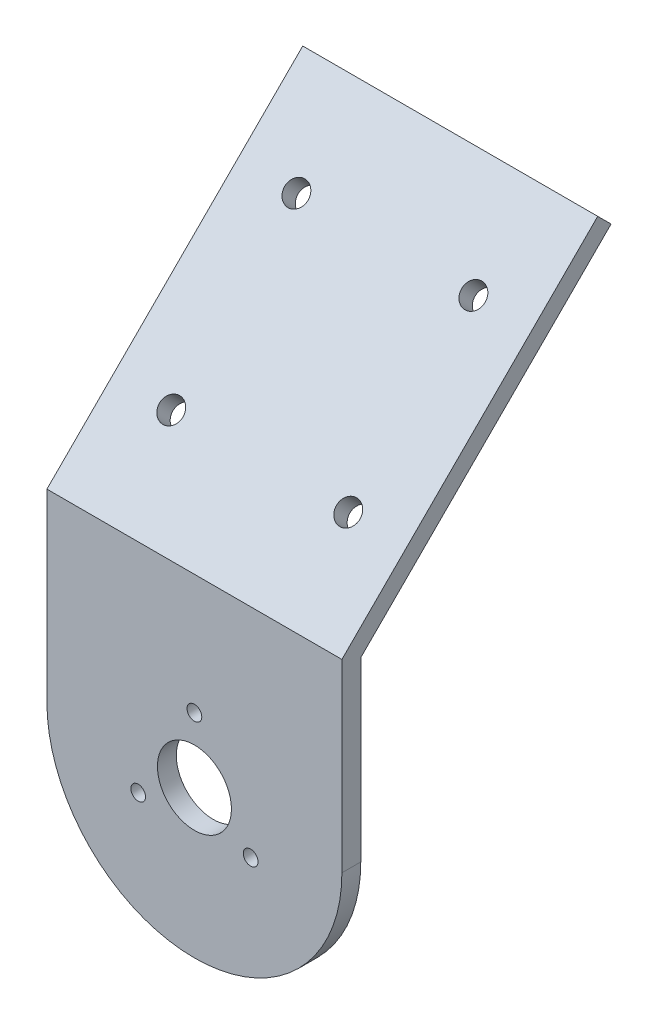
ISO-10303-21;
HEADER;
FILE_DESCRIPTION(('STEP AP214'),'2;1');
FILE_NAME('part.step','',(''),(''),'','','');
FILE_SCHEMA(('AUTOMOTIVE_DESIGN { 1 0 10303 214 1 1 1 1 }'));
ENDSEC;
DATA;
#1=APPLICATION_CONTEXT('core data for automotive mechanical design processes');
#2=APPLICATION_PROTOCOL_DEFINITION('international standard','automotive_design',2000,#1);
#3=PRODUCT_CONTEXT('',#1,'mechanical');
#4=PRODUCT('Part','Part','',(#3));
#5=PRODUCT_RELATED_PRODUCT_CATEGORY('part','',(#4));
#6=PRODUCT_DEFINITION_FORMATION('','',#4);
#7=PRODUCT_DEFINITION_CONTEXT('part definition',#1,'design');
#8=PRODUCT_DEFINITION('design','',#6,#7);
#9=PRODUCT_DEFINITION_SHAPE('','',#8);
#10=(LENGTH_UNIT() NAMED_UNIT(*) SI_UNIT(.MILLI.,.METRE.));
#11=(NAMED_UNIT(*) PLANE_ANGLE_UNIT() SI_UNIT($,.RADIAN.));
#12=(NAMED_UNIT(*) SI_UNIT($,.STERADIAN.) SOLID_ANGLE_UNIT());
#13=UNCERTAINTY_MEASURE_WITH_UNIT(LENGTH_MEASURE(1.E-05),#10,'distance_accuracy_value','');
#14=(GEOMETRIC_REPRESENTATION_CONTEXT(3) GLOBAL_UNCERTAINTY_ASSIGNED_CONTEXT((#13)) GLOBAL_UNIT_ASSIGNED_CONTEXT((#10,
#11,#12)) REPRESENTATION_CONTEXT('',''));
#15=CARTESIAN_POINT('',(0.,0.,0.));
#16=DIRECTION('',(0.,0.,1.));
#17=DIRECTION('',(1.,0.,0.));
#18=AXIS2_PLACEMENT_3D('',#15,#16,#17);
#19=CARTESIAN_POINT('',(9.526279441629,-5.5,77.5303437365925));
#20=DIRECTION('',(0.,0.,-1.));
#21=DIRECTION('',(-1.,0.,0.));
#22=AXIS2_PLACEMENT_3D('',#19,#20,#21);
#23=CYLINDRICAL_SURFACE('',#22,1.24999999999999);
#24=CARTESIAN_POINT('',(9.526279441629,-5.5,0.));
#25=DIRECTION('',(0.,0.,1.));
#26=DIRECTION('',(1.,0.,0.));
#27=AXIS2_PLACEMENT_3D('',#24,#25,#26);
#28=CIRCLE('',#27,1.24999999999999);
#29=CARTESIAN_POINT('',(10.776279441629,-5.5,0.));
#30=VERTEX_POINT('',#29);
#31=EDGE_CURVE('E120',#30,#30,#28,.T.);
#32=ORIENTED_EDGE('',*,*,#31,.F.);
#33=EDGE_LOOP('',(#32));
#34=FACE_BOUND('',#33,.T.);
#35=CARTESIAN_POINT('',(9.526279441629,-5.5,3.19999999999999));
#36=DIRECTION('',(0.,0.,1.));
#37=DIRECTION('',(1.,0.,0.));
#38=AXIS2_PLACEMENT_3D('',#35,#36,#37);
#39=CIRCLE('',#38,1.24999999999999);
#40=CARTESIAN_POINT('',(10.776279441629,-5.5,3.19999999999999));
#41=VERTEX_POINT('',#40);
#42=EDGE_CURVE('E139',#41,#41,#39,.T.);
#43=ORIENTED_EDGE('',*,*,#42,.T.);
#44=EDGE_LOOP('',(#43));
#45=FACE_BOUND('',#44,.T.);
#46=ADVANCED_FACE('F32',(#34,#45),#23,.F.);
#47=CARTESIAN_POINT('',(0.,11.,77.5303437365925));
#48=DIRECTION('',(0.,0.,-1.));
#49=DIRECTION('',(-1.,0.,0.));
#50=AXIS2_PLACEMENT_3D('',#47,#48,#49);
#51=CYLINDRICAL_SURFACE('',#50,1.24999999999999);
#52=CARTESIAN_POINT('',(0.,11.,0.));
#53=DIRECTION('',(0.,0.,1.));
#54=DIRECTION('',(1.,0.,0.));
#55=AXIS2_PLACEMENT_3D('',#52,#53,#54);
#56=CIRCLE('',#55,1.24999999999999);
#57=CARTESIAN_POINT('',(1.24999999999999,11.,0.));
#58=VERTEX_POINT('',#57);
#59=EDGE_CURVE('E117',#58,#58,#56,.T.);
#60=ORIENTED_EDGE('',*,*,#59,.F.);
#61=EDGE_LOOP('',(#60));
#62=FACE_BOUND('',#61,.T.);
#63=CARTESIAN_POINT('',(0.,11.,3.19999999999999));
#64=DIRECTION('',(0.,0.,1.));
#65=DIRECTION('',(1.,0.,0.));
#66=AXIS2_PLACEMENT_3D('',#63,#64,#65);
#67=CIRCLE('',#66,1.24999999999999);
#68=CARTESIAN_POINT('',(1.24999999999999,11.,3.19999999999999));
#69=VERTEX_POINT('',#68);
#70=EDGE_CURVE('E136',#69,#69,#67,.T.);
#71=ORIENTED_EDGE('',*,*,#70,.T.);
#72=EDGE_LOOP('',(#71));
#73=FACE_BOUND('',#72,.T.);
#74=ADVANCED_FACE('F208',(#62,#73),#51,.F.);
#75=CARTESIAN_POINT('',(0.,0.,77.5303437365925));
#76=DIRECTION('',(0.,0.,-1.));
#77=DIRECTION('',(-1.,0.,0.));
#78=AXIS2_PLACEMENT_3D('',#75,#76,#77);
#79=CYLINDRICAL_SURFACE('',#78,6.27324302627625);
#80=CARTESIAN_POINT('',(0.,0.,0.));
#81=DIRECTION('',(0.,0.,1.));
#82=DIRECTION('',(1.,0.,0.));
#83=AXIS2_PLACEMENT_3D('',#80,#81,#82);
#84=CIRCLE('',#83,6.27324302627625);
#85=CARTESIAN_POINT('',(6.27324302627625,0.,0.));
#86=VERTEX_POINT('',#85);
#87=EDGE_CURVE('E114',#86,#86,#84,.T.);
#88=ORIENTED_EDGE('',*,*,#87,.F.);
#89=EDGE_LOOP('',(#88));
#90=FACE_BOUND('',#89,.T.);
#91=CARTESIAN_POINT('',(0.,0.,3.19999999999999));
#92=DIRECTION('',(0.,0.,1.));
#93=DIRECTION('',(1.,0.,0.));
#94=AXIS2_PLACEMENT_3D('',#91,#92,#93);
#95=CIRCLE('',#94,6.27324302627625);
#96=CARTESIAN_POINT('',(6.27324302627625,0.,3.19999999999999));
#97=VERTEX_POINT('',#96);
#98=EDGE_CURVE('E133',#97,#97,#95,.T.);
#99=ORIENTED_EDGE('',*,*,#98,.T.);
#100=EDGE_LOOP('',(#99));
#101=FACE_BOUND('',#100,.T.);
#102=ADVANCED_FACE('F214',(#90,#101),#79,.F.);
#103=CARTESIAN_POINT('',(-25.,0.,77.5303437365925));
#104=DIRECTION('',(1.,0.,0.));
#105=DIRECTION('',(0.,1.,0.));
#106=AXIS2_PLACEMENT_3D('',#103,#104,#105);
#107=PLANE('',#106);
#108=DIRECTION('',(0.,-1.,0.));
#109=VECTOR('',#108,1.);
#110=CARTESIAN_POINT('',(-25.,0.,3.19999999999999));
#111=LINE('',#110,#109);
#112=CARTESIAN_POINT('',(-25.,31.3254833995939,3.19999999999999));
#113=VERTEX_POINT('',#112);
#114=CARTESIAN_POINT('',(-25.,0.,3.19999999999999));
#115=VERTEX_POINT('',#114);
#116=EDGE_CURVE('E130',#113,#115,#111,.T.);
#117=ORIENTED_EDGE('',*,*,#116,.F.);
#118=DIRECTION('',(0.,0.707106781186547,-0.707106781186549));
#119=VECTOR('',#118,1.);
#120=CARTESIAN_POINT('',(-25.,74.6891485709897,-40.163665171396));
#121=LINE('',#120,#119);
#122=CARTESIAN_POINT('',(-25.,74.6891485709897,-40.163665171396));
#123=VERTEX_POINT('',#122);
#124=EDGE_CURVE('E144',#113,#123,#121,.T.);
#125=ORIENTED_EDGE('',*,*,#124,.T.);
#126=DIRECTION('',(0.,-0.707106781186549,-0.707106781186546));
#127=VECTOR('',#126,1.);
#128=CARTESIAN_POINT('',(-25.,72.4264068711927,-42.4264068711929));
#129=LINE('',#128,#127);
#130=CARTESIAN_POINT('',(-25.,72.4264068711928,-42.4264068711929));
#131=VERTEX_POINT('',#130);
#132=EDGE_CURVE('E152',#123,#131,#129,.T.);
#133=ORIENTED_EDGE('',*,*,#132,.T.);
#134=DIRECTION('',(0.,-0.707106781186546,0.707106781186549));
#135=VECTOR('',#134,1.);
#136=CARTESIAN_POINT('',(-25.,30.,0.));
#137=LINE('',#136,#135);
#138=CARTESIAN_POINT('',(-25.,30.,0.));
#139=VERTEX_POINT('',#138);
#140=EDGE_CURVE('E142',#131,#139,#137,.T.);
#141=ORIENTED_EDGE('',*,*,#140,.T.);
#142=DIRECTION('',(0.,-1.,0.));
#143=VECTOR('',#142,1.);
#144=CARTESIAN_POINT('',(-25.,0.,0.));
#145=LINE('',#144,#143);
#146=CARTESIAN_POINT('',(-25.,0.,0.));
#147=VERTEX_POINT('',#146);
#148=EDGE_CURVE('E108',#139,#147,#145,.T.);
#149=ORIENTED_EDGE('',*,*,#148,.T.);
#150=DIRECTION('',(0.,0.,-1.));
#151=VECTOR('',#150,1.);
#152=CARTESIAN_POINT('',(-25.,0.,77.5303437365925));
#153=LINE('',#152,#151);
#154=EDGE_CURVE('E41',#115,#147,#153,.T.);
#155=ORIENTED_EDGE('',*,*,#154,.F.);
#156=EDGE_LOOP('',(#117,#125,#133,#141,#149,#155));
#157=FACE_BOUND('',#156,.T.);
#158=ADVANCED_FACE('F206',(#157),#107,.F.);
#159=CARTESIAN_POINT('',(25.,30.,77.5303437365925));
#160=DIRECTION('',(-1.,0.,0.));
#161=DIRECTION('',(0.,-1.,0.));
#162=AXIS2_PLACEMENT_3D('',#159,#160,#161);
#163=PLANE('',#162);
#164=DIRECTION('',(0.,1.,0.));
#165=VECTOR('',#164,1.);
#166=CARTESIAN_POINT('',(25.,30.,3.19999999999999));
#167=LINE('',#166,#165);
#168=CARTESIAN_POINT('',(25.,0.,3.19999999999999));
#169=VERTEX_POINT('',#168);
#170=CARTESIAN_POINT('',(25.,31.3254833995939,3.19999999999999));
#171=VERTEX_POINT('',#170);
#172=EDGE_CURVE('E47',#169,#171,#167,.T.);
#173=ORIENTED_EDGE('',*,*,#172,.F.);
#174=DIRECTION('',(0.,0.,-1.));
#175=VECTOR('',#174,1.);
#176=CARTESIAN_POINT('',(25.,0.,77.5303437365925));
#177=LINE('',#176,#175);
#178=CARTESIAN_POINT('',(25.,0.,0.));
#179=VERTEX_POINT('',#178);
#180=EDGE_CURVE('E11',#169,#179,#177,.T.);
#181=ORIENTED_EDGE('',*,*,#180,.T.);
#182=DIRECTION('',(0.,1.,0.));
#183=VECTOR('',#182,1.);
#184=CARTESIAN_POINT('',(25.,30.,0.));
#185=LINE('',#184,#183);
#186=CARTESIAN_POINT('',(25.,30.,0.));
#187=VERTEX_POINT('',#186);
#188=EDGE_CURVE('E99',#179,#187,#185,.T.);
#189=ORIENTED_EDGE('',*,*,#188,.T.);
#190=DIRECTION('',(0.,0.707106781186546,-0.707106781186549));
#191=VECTOR('',#190,1.);
#192=CARTESIAN_POINT('',(25.,30.,0.));
#193=LINE('',#192,#191);
#194=CARTESIAN_POINT('',(25.,72.4264068711928,-42.4264068711929));
#195=VERTEX_POINT('',#194);
#196=EDGE_CURVE('E84',#187,#195,#193,.T.);
#197=ORIENTED_EDGE('',*,*,#196,.T.);
#198=DIRECTION('',(0.,0.707106781186548,0.707106781186546));
#199=VECTOR('',#198,1.);
#200=CARTESIAN_POINT('',(25.,72.4264068711928,-42.4264068711929));
#201=LINE('',#200,#199);
#202=CARTESIAN_POINT('',(25.,74.6891485709897,-40.163665171396));
#203=VERTEX_POINT('',#202);
#204=EDGE_CURVE('E95',#195,#203,#201,.T.);
#205=ORIENTED_EDGE('',*,*,#204,.T.);
#206=DIRECTION('',(0.,-0.707106781186547,0.707106781186548));
#207=VECTOR('',#206,1.);
#208=CARTESIAN_POINT('',(25.,74.6891485709897,-40.163665171396));
#209=LINE('',#208,#207);
#210=EDGE_CURVE('E147',#203,#171,#209,.T.);
#211=ORIENTED_EDGE('',*,*,#210,.T.);
#212=EDGE_LOOP('',(#173,#181,#189,#197,#205,#211));
#213=FACE_BOUND('',#212,.T.);
#214=ADVANCED_FACE('F100',(#213),#163,.F.);
#215=CARTESIAN_POINT('',(0.,0.,77.5303437365925));
#216=DIRECTION('',(0.,0.,-1.));
#217=DIRECTION('',(-1.,0.,0.));
#218=AXIS2_PLACEMENT_3D('',#215,#216,#217);
#219=CYLINDRICAL_SURFACE('',#218,25.);
#220=CARTESIAN_POINT('',(0.,0.,3.19999999999999));
#221=DIRECTION('',(0.,0.,1.));
#222=DIRECTION('',(1.,0.,0.));
#223=AXIS2_PLACEMENT_3D('',#220,#221,#222);
#224=CIRCLE('',#223,25.);
#225=EDGE_CURVE('E126',#115,#169,#224,.T.);
#226=ORIENTED_EDGE('',*,*,#225,.F.);
#227=ORIENTED_EDGE('',*,*,#154,.T.);
#228=CARTESIAN_POINT('',(0.,0.,0.));
#229=DIRECTION('',(0.,0.,1.));
#230=DIRECTION('',(1.,0.,0.));
#231=AXIS2_PLACEMENT_3D('',#228,#229,#230);
#232=CIRCLE('',#231,25.);
#233=EDGE_CURVE('E103',#147,#179,#232,.T.);
#234=ORIENTED_EDGE('',*,*,#233,.T.);
#235=ORIENTED_EDGE('',*,*,#180,.F.);
#236=EDGE_LOOP('',(#226,#227,#234,#235));
#237=FACE_BOUND('',#236,.T.);
#238=ADVANCED_FACE('F34',(#237),#219,.T.);
#239=CARTESIAN_POINT('',(0.,0.,0.));
#240=DIRECTION('',(0.,0.,1.));
#241=DIRECTION('',(1.,0.,0.));
#242=AXIS2_PLACEMENT_3D('',#239,#240,#241);
#243=PLANE('',#242);
#244=ORIENTED_EDGE('',*,*,#233,.F.);
#245=ORIENTED_EDGE('',*,*,#148,.F.);
#246=DIRECTION('',(-1.,0.,0.));
#247=VECTOR('',#246,1.);
#248=CARTESIAN_POINT('',(-25.,30.,0.));
#249=LINE('',#248,#247);
#250=EDGE_CURVE('E89',#187,#139,#249,.T.);
#251=ORIENTED_EDGE('',*,*,#250,.F.);
#252=ORIENTED_EDGE('',*,*,#188,.F.);
#253=EDGE_LOOP('',(#244,#245,#251,#252));
#254=FACE_BOUND('',#253,.T.);
#255=ORIENTED_EDGE('',*,*,#87,.T.);
#256=EDGE_LOOP('',(#255));
#257=FACE_BOUND('',#256,.T.);
#258=ORIENTED_EDGE('',*,*,#59,.T.);
#259=EDGE_LOOP('',(#258));
#260=FACE_BOUND('',#259,.T.);
#261=ORIENTED_EDGE('',*,*,#31,.T.);
#262=EDGE_LOOP('',(#261));
#263=FACE_BOUND('',#262,.T.);
#264=CARTESIAN_POINT('',(-9.526279441629,-5.5,0.));
#265=DIRECTION('',(0.,0.,1.));
#266=DIRECTION('',(1.,0.,0.));
#267=AXIS2_PLACEMENT_3D('',#264,#265,#266);
#268=CIRCLE('',#267,1.24999999999999);
#269=CARTESIAN_POINT('',(-8.27627944162901,-5.5,0.));
#270=VERTEX_POINT('',#269);
#271=EDGE_CURVE('E123',#270,#270,#268,.T.);
#272=ORIENTED_EDGE('',*,*,#271,.T.);
#273=EDGE_LOOP('',(#272));
#274=FACE_BOUND('',#273,.T.);
#275=ADVANCED_FACE('F106',(#254,#257,#260,#263,#274),#243,.F.);
#276=CARTESIAN_POINT('',(-9.526279441629,-5.5,77.5303437365925));
#277=DIRECTION('',(0.,0.,-1.));
#278=DIRECTION('',(-1.,0.,0.));
#279=AXIS2_PLACEMENT_3D('',#276,#277,#278);
#280=CYLINDRICAL_SURFACE('',#279,1.24999999999999);
#281=ORIENTED_EDGE('',*,*,#271,.F.);
#282=EDGE_LOOP('',(#281));
#283=FACE_BOUND('',#282,.T.);
#284=CARTESIAN_POINT('',(-9.526279441629,-5.5,3.19999999999999));
#285=DIRECTION('',(0.,0.,1.));
#286=DIRECTION('',(1.,0.,0.));
#287=AXIS2_PLACEMENT_3D('',#284,#285,#286);
#288=CIRCLE('',#287,1.24999999999999);
#289=CARTESIAN_POINT('',(-8.27627944162901,-5.5,3.19999999999999));
#290=VERTEX_POINT('',#289);
#291=EDGE_CURVE('E36',#290,#290,#288,.T.);
#292=ORIENTED_EDGE('',*,*,#291,.T.);
#293=EDGE_LOOP('',(#292));
#294=FACE_BOUND('',#293,.T.);
#295=ADVANCED_FACE('F204',(#283,#294),#280,.F.);
#296=CARTESIAN_POINT('',(0.,0.,3.2));
#297=DIRECTION('',(0.,0.,1.));
#298=DIRECTION('',(1.,0.,0.));
#299=AXIS2_PLACEMENT_3D('',#296,#297,#298);
#300=PLANE('',#299);
#301=ORIENTED_EDGE('',*,*,#291,.F.);
#302=EDGE_LOOP('',(#301));
#303=FACE_BOUND('',#302,.T.);
#304=ORIENTED_EDGE('',*,*,#42,.F.);
#305=EDGE_LOOP('',(#304));
#306=FACE_BOUND('',#305,.T.);
#307=ORIENTED_EDGE('',*,*,#70,.F.);
#308=EDGE_LOOP('',(#307));
#309=FACE_BOUND('',#308,.T.);
#310=ORIENTED_EDGE('',*,*,#98,.F.);
#311=EDGE_LOOP('',(#310));
#312=FACE_BOUND('',#311,.T.);
#313=ORIENTED_EDGE('',*,*,#116,.T.);
#314=ORIENTED_EDGE('',*,*,#225,.T.);
#315=ORIENTED_EDGE('',*,*,#172,.T.);
#316=DIRECTION('',(1.,0.,0.));
#317=VECTOR('',#316,1.);
#318=CARTESIAN_POINT('',(-88.8661804398512,31.3254833995938,3.19999999999999));
#319=LINE('',#318,#317);
#320=EDGE_CURVE('E149',#113,#171,#319,.T.);
#321=ORIENTED_EDGE('',*,*,#320,.F.);
#322=EDGE_LOOP('',(#313,#314,#315,#321));
#323=FACE_BOUND('',#322,.T.);
#324=ADVANCED_FACE('F187',(#303,#306,#309,#312,#323),#300,.T.);
#325=CARTESIAN_POINT('',(-88.8661804398512,74.6891485709897,-40.163665171396));
#326=DIRECTION('',(0.,0.707106781186549,0.707106781186547));
#327=DIRECTION('',(0.,-0.707106781186547,0.707106781186549));
#328=AXIS2_PLACEMENT_3D('',#325,#326,#327);
#329=PLANE('',#328);
#330=CARTESIAN_POINT('',(-15.,42.4007142674936,-7.87523086789976));
#331=DIRECTION('',(0.,0.707106781186549,0.707106781186547));
#332=DIRECTION('',(0.,-0.707106781186547,0.707106781186549));
#333=AXIS2_PLACEMENT_3D('',#330,#331,#332);
#334=CIRCLE('',#333,2.);
#335=CARTESIAN_POINT('',(-15.,40.9865007051205,-6.46101730552666));
#336=VERTEX_POINT('',#335);
#337=EDGE_CURVE('E166',#336,#336,#334,.T.);
#338=ORIENTED_EDGE('',*,*,#337,.F.);
#339=EDGE_LOOP('',(#338));
#340=FACE_BOUND('',#339,.T.);
#341=CARTESIAN_POINT('',(15.,63.61391770309,-29.0884343034962));
#342=DIRECTION('',(0.,0.707106781186549,0.707106781186547));
#343=DIRECTION('',(0.,-0.707106781186547,0.707106781186549));
#344=AXIS2_PLACEMENT_3D('',#341,#342,#343);
#345=CIRCLE('',#344,2.00000000000001);
#346=CARTESIAN_POINT('',(15.,62.1997041407169,-27.6742207411231));
#347=VERTEX_POINT('',#346);
#348=EDGE_CURVE('E172',#347,#347,#345,.T.);
#349=ORIENTED_EDGE('',*,*,#348,.F.);
#350=EDGE_LOOP('',(#349));
#351=FACE_BOUND('',#350,.T.);
#352=CARTESIAN_POINT('',(-15.,63.61391770309,-29.0884343034962));
#353=DIRECTION('',(0.,0.707106781186549,0.707106781186547));
#354=DIRECTION('',(0.,-0.707106781186547,0.707106781186549));
#355=AXIS2_PLACEMENT_3D('',#352,#353,#354);
#356=CIRCLE('',#355,2.);
#357=CARTESIAN_POINT('',(-15.,62.1997041407169,-27.6742207411231));
#358=VERTEX_POINT('',#357);
#359=EDGE_CURVE('E160',#358,#358,#356,.T.);
#360=ORIENTED_EDGE('',*,*,#359,.F.);
#361=EDGE_LOOP('',(#360));
#362=FACE_BOUND('',#361,.T.);
#363=CARTESIAN_POINT('',(15.,42.4007142674936,-7.87523086789975));
#364=DIRECTION('',(0.,0.707106781186549,0.707106781186547));
#365=DIRECTION('',(0.,-0.707106781186547,0.707106781186549));
#366=AXIS2_PLACEMENT_3D('',#363,#364,#365);
#367=CIRCLE('',#366,2.00000000000001);
#368=CARTESIAN_POINT('',(15.,40.9865007051205,-6.46101730552665));
#369=VERTEX_POINT('',#368);
#370=EDGE_CURVE('E96',#369,#369,#367,.T.);
#371=ORIENTED_EDGE('',*,*,#370,.F.);
#372=EDGE_LOOP('',(#371));
#373=FACE_BOUND('',#372,.T.);
#374=ORIENTED_EDGE('',*,*,#124,.F.);
#375=ORIENTED_EDGE('',*,*,#320,.T.);
#376=ORIENTED_EDGE('',*,*,#210,.F.);
#377=DIRECTION('',(1.,0.,0.));
#378=VECTOR('',#377,1.);
#379=CARTESIAN_POINT('',(-88.8661804398512,74.6891485709897,-40.163665171396));
#380=LINE('',#379,#378);
#381=EDGE_CURVE('E146',#123,#203,#380,.T.);
#382=ORIENTED_EDGE('',*,*,#381,.F.);
#383=EDGE_LOOP('',(#374,#375,#376,#382));
#384=FACE_BOUND('',#383,.T.);
#385=ADVANCED_FACE('F183',(#340,#351,#362,#373,#384),#329,.T.);
#386=CARTESIAN_POINT('',(-88.8661804398512,72.4264068711927,-42.4264068711929));
#387=DIRECTION('',(0.,0.707106781186546,-0.707106781186549));
#388=DIRECTION('',(0.,0.707106781186549,0.707106781186546));
#389=AXIS2_PLACEMENT_3D('',#386,#387,#388);
#390=PLANE('',#389);
#391=ORIENTED_EDGE('',*,*,#132,.F.);
#392=ORIENTED_EDGE('',*,*,#381,.T.);
#393=ORIENTED_EDGE('',*,*,#204,.F.);
#394=DIRECTION('',(1.,0.,0.));
#395=VECTOR('',#394,1.);
#396=CARTESIAN_POINT('',(-88.8661804398512,72.4264068711927,-42.4264068711929));
#397=LINE('',#396,#395);
#398=EDGE_CURVE('E92',#131,#195,#397,.T.);
#399=ORIENTED_EDGE('',*,*,#398,.F.);
#400=EDGE_LOOP('',(#391,#392,#393,#399));
#401=FACE_BOUND('',#400,.T.);
#402=ADVANCED_FACE('F186',(#401),#390,.T.);
#403=CARTESIAN_POINT('',(-88.8661804398512,30.,0.));
#404=DIRECTION('',(0.,-0.707106781186549,-0.707106781186546));
#405=DIRECTION('',(0.,0.707106781186546,-0.707106781186549));
#406=AXIS2_PLACEMENT_3D('',#403,#404,#405);
#407=PLANE('',#406);
#408=CARTESIAN_POINT('',(-15.,40.1379725676967,-10.1379725676967));
#409=DIRECTION('',(0.,-0.707106781186549,-0.707106781186546));
#410=DIRECTION('',(0.,0.707106781186546,-0.707106781186549));
#411=AXIS2_PLACEMENT_3D('',#408,#409,#410);
#412=CIRCLE('',#411,2.);
#413=CARTESIAN_POINT('',(-15.,41.5521861300697,-11.5521861300698));
#414=VERTEX_POINT('',#413);
#415=EDGE_CURVE('E163',#414,#414,#412,.F.);
#416=ORIENTED_EDGE('',*,*,#415,.T.);
#417=EDGE_LOOP('',(#416));
#418=FACE_BOUND('',#417,.T.);
#419=CARTESIAN_POINT('',(15.,61.3511760032931,-31.3511760032932));
#420=DIRECTION('',(0.,-0.707106781186549,-0.707106781186546));
#421=DIRECTION('',(0.,0.707106781186546,-0.707106781186549));
#422=AXIS2_PLACEMENT_3D('',#419,#420,#421);
#423=CIRCLE('',#422,2.00000000000001);
#424=CARTESIAN_POINT('',(15.,62.7653895656662,-32.7653895656663));
#425=VERTEX_POINT('',#424);
#426=EDGE_CURVE('E169',#425,#425,#423,.F.);
#427=ORIENTED_EDGE('',*,*,#426,.T.);
#428=EDGE_LOOP('',(#427));
#429=FACE_BOUND('',#428,.T.);
#430=CARTESIAN_POINT('',(-15.,61.351176003293,-31.3511760032932));
#431=DIRECTION('',(0.,-0.707106781186549,-0.707106781186546));
#432=DIRECTION('',(0.,0.707106781186546,-0.707106781186549));
#433=AXIS2_PLACEMENT_3D('',#430,#431,#432);
#434=CIRCLE('',#433,2.);
#435=CARTESIAN_POINT('',(-15.,62.7653895656661,-32.7653895656663));
#436=VERTEX_POINT('',#435);
#437=EDGE_CURVE('E175',#436,#436,#434,.F.);
#438=ORIENTED_EDGE('',*,*,#437,.T.);
#439=EDGE_LOOP('',(#438));
#440=FACE_BOUND('',#439,.T.);
#441=CARTESIAN_POINT('',(15.,40.1379725676967,-10.1379725676967));
#442=DIRECTION('',(0.,-0.707106781186549,-0.707106781186546));
#443=DIRECTION('',(0.,0.707106781186546,-0.707106781186549));
#444=AXIS2_PLACEMENT_3D('',#441,#442,#443);
#445=CIRCLE('',#444,2.00000000000001);
#446=CARTESIAN_POINT('',(15.,41.5521861300698,-11.5521861300698));
#447=VERTEX_POINT('',#446);
#448=EDGE_CURVE('E157',#447,#447,#445,.F.);
#449=ORIENTED_EDGE('',*,*,#448,.T.);
#450=EDGE_LOOP('',(#449));
#451=FACE_BOUND('',#450,.T.);
#452=ORIENTED_EDGE('',*,*,#140,.F.);
#453=ORIENTED_EDGE('',*,*,#398,.T.);
#454=ORIENTED_EDGE('',*,*,#196,.F.);
#455=ORIENTED_EDGE('',*,*,#250,.T.);
#456=EDGE_LOOP('',(#452,#453,#454,#455));
#457=FACE_BOUND('',#456,.T.);
#458=ADVANCED_FACE('F87',(#418,#429,#440,#451,#457),#407,.T.);
#459=CARTESIAN_POINT('',(15.,-8.57623086789989,-58.8521760032931));
#460=DIRECTION('',(0.,0.707106781186548,0.707106781186546));
#461=DIRECTION('',(0.,-0.707106781186547,0.707106781186549));
#462=AXIS2_PLACEMENT_3D('',#459,#460,#461);
#463=CYLINDRICAL_SURFACE('',#462,2.00000000000001);
#464=ORIENTED_EDGE('',*,*,#448,.F.);
#465=EDGE_LOOP('',(#464));
#466=FACE_BOUND('',#465,.T.);
#467=ORIENTED_EDGE('',*,*,#370,.T.);
#468=EDGE_LOOP('',(#467));
#469=FACE_BOUND('',#468,.T.);
#470=ADVANCED_FACE('F234',(#466,#469),#463,.F.);
#471=CARTESIAN_POINT('',(-15.,12.6369725676965,-80.0653794388896));
#472=DIRECTION('',(0.,0.707106781186548,0.707106781186546));
#473=DIRECTION('',(0.,-0.707106781186547,0.707106781186549));
#474=AXIS2_PLACEMENT_3D('',#471,#472,#473);
#475=CYLINDRICAL_SURFACE('',#474,2.);
#476=ORIENTED_EDGE('',*,*,#437,.F.);
#477=EDGE_LOOP('',(#476));
#478=FACE_BOUND('',#477,.T.);
#479=ORIENTED_EDGE('',*,*,#359,.T.);
#480=EDGE_LOOP('',(#479));
#481=FACE_BOUND('',#480,.T.);
#482=ADVANCED_FACE('F181',(#478,#481),#475,.F.);
#483=CARTESIAN_POINT('',(15.,12.6369725676965,-80.0653794388896));
#484=DIRECTION('',(0.,0.707106781186548,0.707106781186546));
#485=DIRECTION('',(0.,-0.707106781186547,0.707106781186549));
#486=AXIS2_PLACEMENT_3D('',#483,#484,#485);
#487=CYLINDRICAL_SURFACE('',#486,2.00000000000001);
#488=ORIENTED_EDGE('',*,*,#426,.F.);
#489=EDGE_LOOP('',(#488));
#490=FACE_BOUND('',#489,.T.);
#491=ORIENTED_EDGE('',*,*,#348,.T.);
#492=EDGE_LOOP('',(#491));
#493=FACE_BOUND('',#492,.T.);
#494=ADVANCED_FACE('F305',(#490,#493),#487,.F.);
#495=CARTESIAN_POINT('',(-15.,-8.57623086789989,-58.8521760032931));
#496=DIRECTION('',(0.,0.707106781186548,0.707106781186546));
#497=DIRECTION('',(0.,-0.707106781186547,0.707106781186549));
#498=AXIS2_PLACEMENT_3D('',#495,#496,#497);
#499=CYLINDRICAL_SURFACE('',#498,2.);
#500=ORIENTED_EDGE('',*,*,#415,.F.);
#501=EDGE_LOOP('',(#500));
#502=FACE_BOUND('',#501,.T.);
#503=ORIENTED_EDGE('',*,*,#337,.T.);
#504=EDGE_LOOP('',(#503));
#505=FACE_BOUND('',#504,.T.);
#506=ADVANCED_FACE('F315',(#502,#505),#499,.F.);
#507=CLOSED_SHELL('',(#46,#74,#102,#158,#214,#238,#275,#295,#324,#385,#402,#458,#470,#482,#494,#506));
#508=MANIFOLD_SOLID_BREP('B2',#507);
#509=ADVANCED_BREP_SHAPE_REPRESENTATION('',(#18,#508),#14);
#510=SHAPE_DEFINITION_REPRESENTATION(#9,#509);
ENDSEC;
END-ISO-10303-21;
